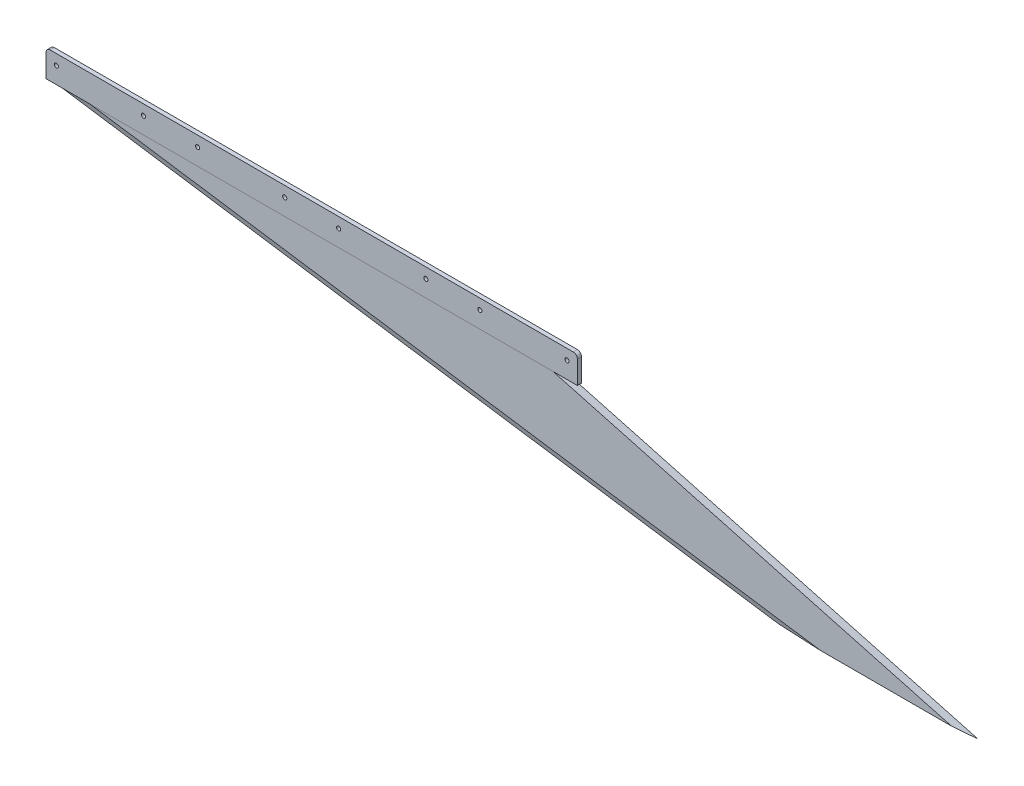
ISO-10303-21;
HEADER;
FILE_DESCRIPTION(('STEP AP214'),'2;1');
FILE_NAME('part.step','',(''),(''),'','','');
FILE_SCHEMA(('AUTOMOTIVE_DESIGN { 1 0 10303 214 1 1 1 1 }'));
ENDSEC;
DATA;
#1=APPLICATION_CONTEXT('core data for automotive mechanical design processes');
#2=APPLICATION_PROTOCOL_DEFINITION('international standard','automotive_design',2000,#1);
#3=PRODUCT_CONTEXT('',#1,'mechanical');
#4=PRODUCT('Part','Part','',(#3));
#5=PRODUCT_RELATED_PRODUCT_CATEGORY('part','',(#4));
#6=PRODUCT_DEFINITION_FORMATION('','',#4);
#7=PRODUCT_DEFINITION_CONTEXT('part definition',#1,'design');
#8=PRODUCT_DEFINITION('design','',#6,#7);
#9=PRODUCT_DEFINITION_SHAPE('','',#8);
#10=(LENGTH_UNIT() NAMED_UNIT(*) SI_UNIT(.MILLI.,.METRE.));
#11=(NAMED_UNIT(*) PLANE_ANGLE_UNIT() SI_UNIT($,.RADIAN.));
#12=(NAMED_UNIT(*) SI_UNIT($,.STERADIAN.) SOLID_ANGLE_UNIT());
#13=UNCERTAINTY_MEASURE_WITH_UNIT(LENGTH_MEASURE(1.E-05),#10,'distance_accuracy_value','');
#14=(GEOMETRIC_REPRESENTATION_CONTEXT(3) GLOBAL_UNCERTAINTY_ASSIGNED_CONTEXT((#13)) GLOBAL_UNIT_ASSIGNED_CONTEXT((#10,
#11,#12)) REPRESENTATION_CONTEXT('',''));
#15=CARTESIAN_POINT('',(0.,0.,0.));
#16=DIRECTION('',(0.,0.,1.));
#17=DIRECTION('',(1.,0.,0.));
#18=AXIS2_PLACEMENT_3D('',#15,#16,#17);
#19=CARTESIAN_POINT('',(0.,0.,0.));
#20=DIRECTION('',(0.,0.,1.));
#21=DIRECTION('',(1.,0.,0.));
#22=AXIS2_PLACEMENT_3D('',#19,#20,#21);
#23=PLANE('',#22);
#24=CARTESIAN_POINT('',(-231.775,25.4,0.));
#25=DIRECTION('',(0.,0.,1.));
#26=DIRECTION('',(1.,0.,0.));
#27=AXIS2_PLACEMENT_3D('',#24,#25,#26);
#28=CIRCLE('',#27,3.17500000000009);
#29=CARTESIAN_POINT('',(-228.6,25.4,0.));
#30=VERTEX_POINT('',#29);
#31=EDGE_CURVE('E300',#30,#30,#28,.T.);
#32=ORIENTED_EDGE('',*,*,#31,.T.);
#33=EDGE_LOOP('',(#32));
#34=FACE_BOUND('',#33,.T.);
#35=CARTESIAN_POINT('',(-365.125,25.4,0.));
#36=DIRECTION('',(0.,0.,1.));
#37=DIRECTION('',(1.,0.,0.));
#38=AXIS2_PLACEMENT_3D('',#35,#36,#37);
#39=CIRCLE('',#38,3.17500000000009);
#40=CARTESIAN_POINT('',(-361.95,25.4,0.));
#41=VERTEX_POINT('',#40);
#42=EDGE_CURVE('E307',#41,#41,#39,.T.);
#43=ORIENTED_EDGE('',*,*,#42,.T.);
#44=EDGE_LOOP('',(#43));
#45=FACE_BOUND('',#44,.T.);
#46=CARTESIAN_POINT('',(-15.875,25.3999999999999,0.));
#47=DIRECTION('',(0.,0.,1.));
#48=DIRECTION('',(1.,0.,0.));
#49=AXIS2_PLACEMENT_3D('',#46,#47,#48);
#50=CIRCLE('',#49,3.17500000000008);
#51=CARTESIAN_POINT('',(-12.6999999999999,25.3999999999999,0.));
#52=VERTEX_POINT('',#51);
#53=EDGE_CURVE('E278',#52,#52,#50,.T.);
#54=ORIENTED_EDGE('',*,*,#53,.T.);
#55=EDGE_LOOP('',(#54));
#56=FACE_BOUND('',#55,.T.);
#57=CARTESIAN_POINT('',(-581.025,25.4,0.));
#58=DIRECTION('',(0.,0.,-1.));
#59=DIRECTION('',(-1.,0.,0.));
#60=AXIS2_PLACEMENT_3D('',#57,#58,#59);
#61=CIRCLE('',#60,3.17500000000008);
#62=CARTESIAN_POINT('',(-584.2,25.4,0.));
#63=VERTEX_POINT('',#62);
#64=EDGE_CURVE('E288',#63,#63,#61,.T.);
#65=ORIENTED_EDGE('',*,*,#64,.F.);
#66=EDGE_LOOP('',(#65));
#67=FACE_BOUND('',#66,.T.);
#68=CARTESIAN_POINT('',(-149.225,25.4,0.));
#69=DIRECTION('',(0.,0.,-1.));
#70=DIRECTION('',(-1.,0.,0.));
#71=AXIS2_PLACEMENT_3D('',#68,#69,#70);
#72=CIRCLE('',#71,3.175);
#73=CARTESIAN_POINT('',(-152.4,25.4,0.));
#74=VERTEX_POINT('',#73);
#75=EDGE_CURVE('E274',#74,#74,#72,.T.);
#76=ORIENTED_EDGE('',*,*,#75,.F.);
#77=EDGE_LOOP('',(#76));
#78=FACE_BOUND('',#77,.T.);
#79=CARTESIAN_POINT('',(-663.575,25.4,0.));
#80=DIRECTION('',(0.,0.,-1.));
#81=DIRECTION('',(-1.,0.,0.));
#82=AXIS2_PLACEMENT_3D('',#79,#80,#81);
#83=CIRCLE('',#82,3.17500000000008);
#84=CARTESIAN_POINT('',(-666.75,25.4,0.));
#85=VERTEX_POINT('',#84);
#86=EDGE_CURVE('E281',#85,#85,#83,.T.);
#87=ORIENTED_EDGE('',*,*,#86,.F.);
#88=EDGE_LOOP('',(#87));
#89=FACE_BOUND('',#88,.T.);
#90=CARTESIAN_POINT('',(-447.675,25.4,0.));
#91=DIRECTION('',(0.,0.,-1.));
#92=DIRECTION('',(-1.,0.,0.));
#93=AXIS2_PLACEMENT_3D('',#90,#91,#92);
#94=CIRCLE('',#93,3.17500000000009);
#95=CARTESIAN_POINT('',(-450.85,25.4,0.));
#96=VERTEX_POINT('',#95);
#97=EDGE_CURVE('E310',#96,#96,#94,.T.);
#98=ORIENTED_EDGE('',*,*,#97,.F.);
#99=EDGE_LOOP('',(#98));
#100=FACE_BOUND('',#99,.T.);
#101=CARTESIAN_POINT('',(-796.925,25.4,0.));
#102=DIRECTION('',(0.,0.,-1.));
#103=DIRECTION('',(-1.,0.,0.));
#104=AXIS2_PLACEMENT_3D('',#101,#102,#103);
#105=CIRCLE('',#104,3.17500000000008);
#106=CARTESIAN_POINT('',(-800.1,25.4,0.));
#107=VERTEX_POINT('',#106);
#108=EDGE_CURVE('E271',#107,#107,#105,.T.);
#109=ORIENTED_EDGE('',*,*,#108,.F.);
#110=EDGE_LOOP('',(#109));
#111=FACE_BOUND('',#110,.T.);
#112=DIRECTION('',(1.,0.,0.));
#113=VECTOR('',#112,1.);
#114=CARTESIAN_POINT('',(0.,0.,0.));
#115=LINE('',#114,#113);
#116=CARTESIAN_POINT('',(-745.935604653389,0.,0.));
#117=VERTEX_POINT('',#116);
#118=CARTESIAN_POINT('',(-37.3797503889438,0.,0.));
#119=VERTEX_POINT('',#118);
#120=EDGE_CURVE('E11',#117,#119,#115,.T.);
#121=ORIENTED_EDGE('',*,*,#120,.F.);
#122=DIRECTION('',(-1.,0.,0.));
#123=VECTOR('',#122,1.);
#124=CARTESIAN_POINT('',(-812.8,0.,0.));
#125=LINE('',#124,#123);
#126=CARTESIAN_POINT('',(-812.8,0.,0.));
#127=VERTEX_POINT('',#126);
#128=EDGE_CURVE('E159',#117,#127,#125,.T.);
#129=ORIENTED_EDGE('',*,*,#128,.T.);
#130=DIRECTION('',(0.,-1.,0.));
#131=VECTOR('',#130,1.);
#132=CARTESIAN_POINT('',(-812.8,3.175,0.));
#133=LINE('',#132,#131);
#134=CARTESIAN_POINT('',(-812.8,34.925,0.));
#135=VERTEX_POINT('',#134);
#136=EDGE_CURVE('E163',#135,#127,#133,.T.);
#137=ORIENTED_EDGE('',*,*,#136,.F.);
#138=CARTESIAN_POINT('',(-806.45,34.925,0.));
#139=DIRECTION('',(0.,0.,1.));
#140=DIRECTION('',(1.,0.,0.));
#141=AXIS2_PLACEMENT_3D('',#138,#139,#140);
#142=CIRCLE('',#141,6.35);
#143=CARTESIAN_POINT('',(-806.45,41.275,0.));
#144=VERTEX_POINT('',#143);
#145=EDGE_CURVE('E226',#135,#144,#142,.F.);
#146=ORIENTED_EDGE('',*,*,#145,.T.);
#147=DIRECTION('',(-1.,0.,0.));
#148=VECTOR('',#147,1.);
#149=CARTESIAN_POINT('',(-812.8,41.275,0.));
#150=LINE('',#149,#148);
#151=CARTESIAN_POINT('',(-6.34999999999997,41.275,0.));
#152=VERTEX_POINT('',#151);
#153=EDGE_CURVE('E145',#152,#144,#150,.T.);
#154=ORIENTED_EDGE('',*,*,#153,.F.);
#155=CARTESIAN_POINT('',(-6.35,34.925,0.));
#156=DIRECTION('',(0.,0.,1.));
#157=DIRECTION('',(1.,0.,0.));
#158=AXIS2_PLACEMENT_3D('',#155,#156,#157);
#159=CIRCLE('',#158,6.35);
#160=CARTESIAN_POINT('',(0.,34.925,0.));
#161=VERTEX_POINT('',#160);
#162=EDGE_CURVE('E214',#152,#161,#159,.F.);
#163=ORIENTED_EDGE('',*,*,#162,.T.);
#164=DIRECTION('',(0.,-1.,0.));
#165=VECTOR('',#164,1.);
#166=CARTESIAN_POINT('',(0.,3.175,0.));
#167=LINE('',#166,#165);
#168=CARTESIAN_POINT('',(0.,0.,0.));
#169=VERTEX_POINT('',#168);
#170=EDGE_CURVE('E165',#161,#169,#167,.T.);
#171=ORIENTED_EDGE('',*,*,#170,.T.);
#172=EDGE_CURVE('E160',#169,#119,#125,.T.);
#173=ORIENTED_EDGE('',*,*,#172,.T.);
#174=EDGE_LOOP('',(#121,#129,#137,#146,#154,#163,#171,#173));
#175=FACE_BOUND('',#174,.T.);
#176=ADVANCED_FACE('F40',(#34,#45,#56,#67,#78,#89,#100,#111,#175),#23,.F.);
#177=CARTESIAN_POINT('',(0.,0.,6.35));
#178=DIRECTION('',(0.,0.,1.));
#179=DIRECTION('',(1.,0.,0.));
#180=AXIS2_PLACEMENT_3D('',#177,#178,#179);
#181=PLANE('',#180);
#182=CARTESIAN_POINT('',(-796.925,25.4,6.35));
#183=DIRECTION('',(0.,0.,1.));
#184=DIRECTION('',(1.,0.,0.));
#185=AXIS2_PLACEMENT_3D('',#182,#183,#184);
#186=CIRCLE('',#185,3.17500000000008);
#187=CARTESIAN_POINT('',(-793.75,25.4,6.35));
#188=VERTEX_POINT('',#187);
#189=EDGE_CURVE('E287',#188,#188,#186,.F.);
#190=ORIENTED_EDGE('',*,*,#189,.T.);
#191=EDGE_LOOP('',(#190));
#192=FACE_BOUND('',#191,.T.);
#193=CARTESIAN_POINT('',(-365.125,25.4,6.35));
#194=DIRECTION('',(0.,0.,1.));
#195=DIRECTION('',(1.,0.,0.));
#196=AXIS2_PLACEMENT_3D('',#193,#194,#195);
#197=CIRCLE('',#196,3.17500000000009);
#198=CARTESIAN_POINT('',(-361.95,25.4,6.35));
#199=VERTEX_POINT('',#198);
#200=EDGE_CURVE('E303',#199,#199,#197,.T.);
#201=ORIENTED_EDGE('',*,*,#200,.F.);
#202=EDGE_LOOP('',(#201));
#203=FACE_BOUND('',#202,.T.);
#204=CARTESIAN_POINT('',(-447.675,25.4,6.35));
#205=DIRECTION('',(0.,0.,1.));
#206=DIRECTION('',(1.,0.,0.));
#207=AXIS2_PLACEMENT_3D('',#204,#205,#206);
#208=CIRCLE('',#207,3.17500000000009);
#209=CARTESIAN_POINT('',(-444.5,25.4,6.35));
#210=VERTEX_POINT('',#209);
#211=EDGE_CURVE('E292',#210,#210,#208,.F.);
#212=ORIENTED_EDGE('',*,*,#211,.T.);
#213=EDGE_LOOP('',(#212));
#214=FACE_BOUND('',#213,.T.);
#215=CARTESIAN_POINT('',(-663.575,25.4,6.35));
#216=DIRECTION('',(0.,0.,1.));
#217=DIRECTION('',(1.,0.,0.));
#218=AXIS2_PLACEMENT_3D('',#215,#216,#217);
#219=CIRCLE('',#218,3.17500000000008);
#220=CARTESIAN_POINT('',(-660.4,25.4,6.35));
#221=VERTEX_POINT('',#220);
#222=EDGE_CURVE('E284',#221,#221,#219,.F.);
#223=ORIENTED_EDGE('',*,*,#222,.T.);
#224=EDGE_LOOP('',(#223));
#225=FACE_BOUND('',#224,.T.);
#226=CARTESIAN_POINT('',(-149.225,25.4,6.35));
#227=DIRECTION('',(0.,0.,1.));
#228=DIRECTION('',(1.,0.,0.));
#229=AXIS2_PLACEMENT_3D('',#226,#227,#228);
#230=CIRCLE('',#229,3.175);
#231=CARTESIAN_POINT('',(-146.05,25.4,6.35));
#232=VERTEX_POINT('',#231);
#233=EDGE_CURVE('E277',#232,#232,#230,.F.);
#234=ORIENTED_EDGE('',*,*,#233,.T.);
#235=EDGE_LOOP('',(#234));
#236=FACE_BOUND('',#235,.T.);
#237=CARTESIAN_POINT('',(-581.025,25.4,6.35));
#238=DIRECTION('',(0.,0.,1.));
#239=DIRECTION('',(1.,0.,0.));
#240=AXIS2_PLACEMENT_3D('',#237,#238,#239);
#241=CIRCLE('',#240,3.17500000000008);
#242=CARTESIAN_POINT('',(-577.85,25.4,6.35));
#243=VERTEX_POINT('',#242);
#244=EDGE_CURVE('E291',#243,#243,#241,.F.);
#245=ORIENTED_EDGE('',*,*,#244,.T.);
#246=EDGE_LOOP('',(#245));
#247=FACE_BOUND('',#246,.T.);
#248=CARTESIAN_POINT('',(-15.875,25.3999999999999,6.35));
#249=DIRECTION('',(0.,0.,1.));
#250=DIRECTION('',(1.,0.,0.));
#251=AXIS2_PLACEMENT_3D('',#248,#249,#250);
#252=CIRCLE('',#251,3.17500000000008);
#253=CARTESIAN_POINT('',(-12.6999999999999,25.3999999999999,6.35));
#254=VERTEX_POINT('',#253);
#255=EDGE_CURVE('E295',#254,#254,#252,.T.);
#256=ORIENTED_EDGE('',*,*,#255,.F.);
#257=EDGE_LOOP('',(#256));
#258=FACE_BOUND('',#257,.T.);
#259=CARTESIAN_POINT('',(-231.775,25.4,6.35));
#260=DIRECTION('',(0.,0.,1.));
#261=DIRECTION('',(1.,0.,0.));
#262=AXIS2_PLACEMENT_3D('',#259,#260,#261);
#263=CIRCLE('',#262,3.17500000000009);
#264=CARTESIAN_POINT('',(-228.6,25.4,6.35));
#265=VERTEX_POINT('',#264);
#266=EDGE_CURVE('E304',#265,#265,#263,.T.);
#267=ORIENTED_EDGE('',*,*,#266,.F.);
#268=EDGE_LOOP('',(#267));
#269=FACE_BOUND('',#268,.T.);
#270=DIRECTION('',(1.,0.,0.));
#271=VECTOR('',#270,1.);
#272=CARTESIAN_POINT('',(-812.8,0.,6.35));
#273=LINE('',#272,#271);
#274=CARTESIAN_POINT('',(-812.8,0.,6.35));
#275=VERTEX_POINT('',#274);
#276=CARTESIAN_POINT('',(-745.935604653391,0.,6.35));
#277=VERTEX_POINT('',#276);
#278=EDGE_CURVE('E131',#275,#277,#273,.T.);
#279=ORIENTED_EDGE('',*,*,#278,.T.);
#280=DIRECTION('',(1.,0.,0.));
#281=VECTOR('',#280,1.);
#282=CARTESIAN_POINT('',(0.,0.,6.35));
#283=LINE('',#282,#281);
#284=CARTESIAN_POINT('',(-37.379750388943,0.,6.35));
#285=VERTEX_POINT('',#284);
#286=EDGE_CURVE('E49',#277,#285,#283,.T.);
#287=ORIENTED_EDGE('',*,*,#286,.T.);
#288=CARTESIAN_POINT('',(0.,0.,6.35));
#289=VERTEX_POINT('',#288);
#290=EDGE_CURVE('E150',#285,#289,#273,.T.);
#291=ORIENTED_EDGE('',*,*,#290,.T.);
#292=DIRECTION('',(0.,-1.,0.));
#293=VECTOR('',#292,1.);
#294=CARTESIAN_POINT('',(0.,3.175,6.35));
#295=LINE('',#294,#293);
#296=CARTESIAN_POINT('',(0.,34.925,6.35));
#297=VERTEX_POINT('',#296);
#298=EDGE_CURVE('E134',#297,#289,#295,.T.);
#299=ORIENTED_EDGE('',*,*,#298,.F.);
#300=CARTESIAN_POINT('',(-6.35,34.925,6.35));
#301=DIRECTION('',(0.,0.,1.));
#302=DIRECTION('',(1.,0.,0.));
#303=AXIS2_PLACEMENT_3D('',#300,#301,#302);
#304=CIRCLE('',#303,6.35);
#305=CARTESIAN_POINT('',(-6.34999999999997,41.275,6.35));
#306=VERTEX_POINT('',#305);
#307=EDGE_CURVE('E218',#297,#306,#304,.T.);
#308=ORIENTED_EDGE('',*,*,#307,.T.);
#309=DIRECTION('',(1.,0.,0.));
#310=VECTOR('',#309,1.);
#311=CARTESIAN_POINT('',(-812.8,41.275,6.35));
#312=LINE('',#311,#310);
#313=CARTESIAN_POINT('',(-806.45,41.275,6.35));
#314=VERTEX_POINT('',#313);
#315=EDGE_CURVE('E269',#314,#306,#312,.T.);
#316=ORIENTED_EDGE('',*,*,#315,.F.);
#317=CARTESIAN_POINT('',(-806.45,34.925,6.35));
#318=DIRECTION('',(0.,0.,1.));
#319=DIRECTION('',(1.,0.,0.));
#320=AXIS2_PLACEMENT_3D('',#317,#318,#319);
#321=CIRCLE('',#320,6.35);
#322=CARTESIAN_POINT('',(-812.8,34.925,6.35));
#323=VERTEX_POINT('',#322);
#324=EDGE_CURVE('E64',#314,#323,#321,.T.);
#325=ORIENTED_EDGE('',*,*,#324,.T.);
#326=DIRECTION('',(0.,-1.,0.));
#327=VECTOR('',#326,1.);
#328=CARTESIAN_POINT('',(-812.8,3.175,6.35));
#329=LINE('',#328,#327);
#330=EDGE_CURVE('E127',#323,#275,#329,.T.);
#331=ORIENTED_EDGE('',*,*,#330,.T.);
#332=EDGE_LOOP('',(#279,#287,#291,#299,#308,#316,#325,#331));
#333=FACE_BOUND('',#332,.T.);
#334=ADVANCED_FACE('F129',(#192,#203,#214,#225,#236,#247,#258,#269,#333),#181,.T.);
#335=ORIENTED_EDGE('',*,*,#286,.F.);
#336=DIRECTION('',(-0.989263736217635,0.146141233759423,0.));
#337=VECTOR('',#336,1.);
#338=CARTESIAN_POINT('',(-15.9311408045524,-107.841568523124,6.35));
#339=LINE('',#338,#337);
#340=CARTESIAN_POINT('',(371.664395346609,-165.1,6.35));
#341=VERTEX_POINT('',#340);
#342=EDGE_CURVE('E204',#341,#277,#339,.T.);
#343=ORIENTED_EDGE('',*,*,#342,.F.);
#344=DIRECTION('',(1.,0.,0.));
#345=VECTOR('',#344,1.);
#346=CARTESIAN_POINT('',(304.8,-165.1,6.35));
#347=LINE('',#346,#345);
#348=CARTESIAN_POINT('',(572.220249611057,-165.1,6.35));
#349=VERTEX_POINT('',#348);
#350=EDGE_CURVE('E196',#341,#349,#347,.T.);
#351=ORIENTED_EDGE('',*,*,#350,.T.);
#352=DIRECTION('',(0.965226371919944,-0.261415475728318,0.));
#353=VECTOR('',#352,1.);
#354=CARTESIAN_POINT('',(-2.5544592865877,-9.43184967355457,6.35));
#355=LINE('',#354,#353);
#356=EDGE_CURVE('E209',#285,#349,#355,.T.);
#357=ORIENTED_EDGE('',*,*,#356,.F.);
#358=EDGE_LOOP('',(#335,#343,#351,#357));
#359=FACE_BOUND('',#358,.T.);
#360=ADVANCED_FACE('F242',(#359),#181,.T.);
#361=DIRECTION('',(-0.989263736217635,0.146141233759423,0.));
#362=VECTOR('',#361,1.);
#363=CARTESIAN_POINT('',(-15.9311408045524,-107.841568523124,0.));
#364=LINE('',#363,#362);
#365=CARTESIAN_POINT('',(371.66439534661,-165.1,0.));
#366=VERTEX_POINT('',#365);
#367=EDGE_CURVE('E199',#366,#117,#364,.T.);
#368=ORIENTED_EDGE('',*,*,#367,.T.);
#369=ORIENTED_EDGE('',*,*,#120,.T.);
#370=DIRECTION('',(0.965226371919944,-0.261415475728318,0.));
#371=VECTOR('',#370,1.);
#372=CARTESIAN_POINT('',(-2.55445928658775,-9.43184967355478,0.));
#373=LINE('',#372,#371);
#374=CARTESIAN_POINT('',(572.220249611057,-165.1,0.));
#375=VERTEX_POINT('',#374);
#376=EDGE_CURVE('E206',#119,#375,#373,.T.);
#377=ORIENTED_EDGE('',*,*,#376,.T.);
#378=DIRECTION('',(1.,0.,0.));
#379=VECTOR('',#378,1.);
#380=CARTESIAN_POINT('',(304.8,-165.1,0.));
#381=LINE('',#380,#379);
#382=EDGE_CURVE('E195',#366,#375,#381,.T.);
#383=ORIENTED_EDGE('',*,*,#382,.F.);
#384=EDGE_LOOP('',(#368,#369,#377,#383));
#385=FACE_BOUND('',#384,.T.);
#386=ADVANCED_FACE('F327',(#385),#23,.F.);
#387=CARTESIAN_POINT('',(304.8,-165.1,6.35));
#388=DIRECTION('',(0.,1.,0.));
#389=DIRECTION('',(0.,0.,1.));
#390=AXIS2_PLACEMENT_3D('',#387,#388,#389);
#391=PLANE('',#390);
#392=ORIENTED_EDGE('',*,*,#382,.T.);
#393=DIRECTION('',(0.996412082519267,0.,0.0846342827087045));
#394=VECTOR('',#393,1.);
#395=CARTESIAN_POINT('',(307.25102048406,-165.1,-22.5062311472001));
#396=LINE('',#395,#394);
#397=CARTESIAN_POINT('',(609.6,-165.1,3.175));
#398=VERTEX_POINT('',#397);
#399=EDGE_CURVE('E173',#375,#398,#396,.T.);
#400=ORIENTED_EDGE('',*,*,#399,.T.);
#401=DIRECTION('',(-0.996412082519267,0.,0.0846342827087064));
#402=VECTOR('',#401,1.);
#403=CARTESIAN_POINT('',(306.715521035082,-165.1,28.9017159546918));
#404=LINE('',#403,#402);
#405=EDGE_CURVE('E179',#398,#349,#404,.T.);
#406=ORIENTED_EDGE('',*,*,#405,.T.);
#407=ORIENTED_EDGE('',*,*,#350,.F.);
#408=DIRECTION('',(-0.998874529903472,0.,-0.0474307232721332));
#409=VECTOR('',#408,1.);
#410=CARTESIAN_POINT('',(304.950423058981,-165.1,3.18214271339463));
#411=LINE('',#410,#409);
#412=CARTESIAN_POINT('',(304.799999999999,-165.1,3.17499999999997));
#413=VERTEX_POINT('',#412);
#414=EDGE_CURVE('E192',#341,#413,#411,.T.);
#415=ORIENTED_EDGE('',*,*,#414,.T.);
#416=DIRECTION('',(0.998874529903472,0.,-0.0474307232721321));
#417=VECTOR('',#416,1.);
#418=CARTESIAN_POINT('',(304.649576941019,-165.1,3.18214271339462));
#419=LINE('',#418,#417);
#420=EDGE_CURVE('E188',#413,#366,#419,.T.);
#421=ORIENTED_EDGE('',*,*,#420,.T.);
#422=EDGE_LOOP('',(#392,#400,#406,#407,#415,#421));
#423=FACE_BOUND('',#422,.T.);
#424=ADVANCED_FACE('F245',(#423),#391,.F.);
#425=CARTESIAN_POINT('',(603.090307089599,-209.165613547327,3.175));
#426=DIRECTION('',(0.0451601248105842,0.305699306410108,-0.951056516295152));
#427=DIRECTION('',(0.,0.952027812084015,0.306011511251658));
#428=AXIS2_PLACEMENT_3D('',#425,#426,#427);
#429=PLANE('',#428);
#430=ORIENTED_EDGE('',*,*,#342,.T.);
#431=DIRECTION('',(-0.998874529903472,0.,-0.0474307232721332));
#432=VECTOR('',#431,1.);
#433=CARTESIAN_POINT('',(-812.649576941019,0.,3.18214271339462));
#434=LINE('',#433,#432);
#435=CARTESIAN_POINT('',(-812.8,0.,3.175));
#436=VERTEX_POINT('',#435);
#437=EDGE_CURVE('E148',#277,#436,#434,.T.);
#438=ORIENTED_EDGE('',*,*,#437,.T.);
#439=DIRECTION('',(-0.989263736217635,0.146141233759423,0.));
#440=VECTOR('',#439,1.);
#441=CARTESIAN_POINT('',(603.090307089599,-209.165613547327,3.175));
#442=LINE('',#441,#440);
#443=EDGE_CURVE('E182',#413,#436,#442,.T.);
#444=ORIENTED_EDGE('',*,*,#443,.F.);
#445=ORIENTED_EDGE('',*,*,#414,.F.);
#446=EDGE_LOOP('',(#430,#438,#444,#445));
#447=FACE_BOUND('',#446,.T.);
#448=ADVANCED_FACE('F341',(#447),#429,.F.);
#449=CARTESIAN_POINT('',(603.090307089599,-209.165613547327,3.175));
#450=DIRECTION('',(0.0451601248105833,0.305699306410102,0.951056516295154));
#451=DIRECTION('',(0.,-0.952027812084017,0.306011511251652));
#452=AXIS2_PLACEMENT_3D('',#449,#450,#451);
#453=PLANE('',#452);
#454=ORIENTED_EDGE('',*,*,#443,.T.);
#455=DIRECTION('',(0.998874529903472,0.,-0.0474307232721321));
#456=VECTOR('',#455,1.);
#457=CARTESIAN_POINT('',(-812.950423058981,0.,3.18214271339462));
#458=LINE('',#457,#456);
#459=EDGE_CURVE('E185',#436,#117,#458,.T.);
#460=ORIENTED_EDGE('',*,*,#459,.T.);
#461=ORIENTED_EDGE('',*,*,#367,.F.);
#462=ORIENTED_EDGE('',*,*,#420,.F.);
#463=EDGE_LOOP('',(#454,#460,#461,#462));
#464=FACE_BOUND('',#463,.T.);
#465=ADVANCED_FACE('F344',(#464),#453,.F.);
#466=CARTESIAN_POINT('',(-86.9208631466368,23.5410671022141,3.175));
#467=DIRECTION('',(-0.0807818245926628,-0.29827135234214,-0.951056516295152));
#468=DIRECTION('',(0.,0.954174943337679,-0.299249356735378));
#469=AXIS2_PLACEMENT_3D('',#466,#467,#468);
#470=PLANE('',#469);
#471=DIRECTION('',(0.965226371919944,-0.261415475728318,0.));
#472=VECTOR('',#471,1.);
#473=CARTESIAN_POINT('',(-86.9208631466368,23.5410671022141,3.175));
#474=LINE('',#473,#472);
#475=CARTESIAN_POINT('',(0.,0.,3.17499999999998));
#476=VERTEX_POINT('',#475);
#477=EDGE_CURVE('E133',#476,#398,#474,.T.);
#478=ORIENTED_EDGE('',*,*,#477,.F.);
#479=DIRECTION('',(-0.996412082519267,0.,0.0846342827087064));
#480=VECTOR('',#479,1.);
#481=CARTESIAN_POINT('',(-807.245694365632,0.,71.7416718729355));
#482=LINE('',#481,#480);
#483=EDGE_CURVE('E176',#476,#285,#482,.T.);
#484=ORIENTED_EDGE('',*,*,#483,.T.);
#485=ORIENTED_EDGE('',*,*,#356,.T.);
#486=ORIENTED_EDGE('',*,*,#405,.F.);
#487=EDGE_LOOP('',(#478,#484,#485,#486));
#488=FACE_BOUND('',#487,.T.);
#489=ADVANCED_FACE('F241',(#488),#470,.F.);
#490=CARTESIAN_POINT('',(-86.9208631466368,23.5410671022141,3.175));
#491=DIRECTION('',(-0.0807818245926612,-0.298271352342134,0.951056516295154));
#492=DIRECTION('',(0.,-0.954174943337681,-0.299249356735372));
#493=AXIS2_PLACEMENT_3D('',#490,#491,#492);
#494=PLANE('',#493);
#495=ORIENTED_EDGE('',*,*,#376,.F.);
#496=DIRECTION('',(0.996412082519267,0.,0.0846342827087045));
#497=VECTOR('',#496,1.);
#498=CARTESIAN_POINT('',(-806.710194916654,0.,-65.3461870654429));
#499=LINE('',#498,#497);
#500=EDGE_CURVE('E170',#119,#476,#499,.T.);
#501=ORIENTED_EDGE('',*,*,#500,.T.);
#502=ORIENTED_EDGE('',*,*,#477,.T.);
#503=ORIENTED_EDGE('',*,*,#399,.F.);
#504=EDGE_LOOP('',(#495,#501,#502,#503));
#505=FACE_BOUND('',#504,.T.);
#506=ADVANCED_FACE('F248',(#505),#494,.F.);
#507=CARTESIAN_POINT('',(0.,0.,0.));
#508=DIRECTION('',(0.,1.,0.));
#509=DIRECTION('',(0.,0.,1.));
#510=AXIS2_PLACEMENT_3D('',#507,#508,#509);
#511=PLANE('',#510);
#512=ORIENTED_EDGE('',*,*,#459,.F.);
#513=DIRECTION('',(0.,0.,1.));
#514=VECTOR('',#513,1.);
#515=CARTESIAN_POINT('',(-812.8,0.,0.));
#516=LINE('',#515,#514);
#517=EDGE_CURVE('E141',#127,#436,#516,.T.);
#518=ORIENTED_EDGE('',*,*,#517,.F.);
#519=ORIENTED_EDGE('',*,*,#128,.F.);
#520=EDGE_LOOP('',(#512,#518,#519));
#521=FACE_BOUND('',#520,.T.);
#522=ADVANCED_FACE('F347',(#521),#511,.F.);
#523=ORIENTED_EDGE('',*,*,#437,.F.);
#524=ORIENTED_EDGE('',*,*,#278,.F.);
#525=EDGE_CURVE('E138',#436,#275,#516,.T.);
#526=ORIENTED_EDGE('',*,*,#525,.F.);
#527=EDGE_LOOP('',(#523,#524,#526));
#528=FACE_BOUND('',#527,.T.);
#529=ADVANCED_FACE('F147',(#528),#511,.F.);
#530=ORIENTED_EDGE('',*,*,#500,.F.);
#531=ORIENTED_EDGE('',*,*,#172,.F.);
#532=DIRECTION('',(0.,0.,-1.));
#533=VECTOR('',#532,1.);
#534=CARTESIAN_POINT('',(0.,0.,0.));
#535=LINE('',#534,#533);
#536=EDGE_CURVE('E149',#476,#169,#535,.T.);
#537=ORIENTED_EDGE('',*,*,#536,.F.);
#538=EDGE_LOOP('',(#530,#531,#537));
#539=FACE_BOUND('',#538,.T.);
#540=ADVANCED_FACE('F252',(#539),#511,.F.);
#541=CARTESIAN_POINT('',(-812.8,3.175,0.));
#542=DIRECTION('',(1.,0.,0.));
#543=DIRECTION('',(0.,0.,-1.));
#544=AXIS2_PLACEMENT_3D('',#541,#542,#543);
#545=PLANE('',#544);
#546=ORIENTED_EDGE('',*,*,#330,.F.);
#547=DIRECTION('',(0.,0.,1.));
#548=VECTOR('',#547,1.);
#549=CARTESIAN_POINT('',(-812.8,34.925,0.));
#550=LINE('',#549,#548);
#551=EDGE_CURVE('E56',#323,#135,#550,.F.);
#552=ORIENTED_EDGE('',*,*,#551,.T.);
#553=ORIENTED_EDGE('',*,*,#136,.T.);
#554=ORIENTED_EDGE('',*,*,#517,.T.);
#555=ORIENTED_EDGE('',*,*,#525,.T.);
#556=EDGE_LOOP('',(#546,#552,#553,#554,#555));
#557=FACE_BOUND('',#556,.T.);
#558=ADVANCED_FACE('F139',(#557),#545,.F.);
#559=CARTESIAN_POINT('',(0.,3.175,0.));
#560=DIRECTION('',(-1.,0.,0.));
#561=DIRECTION('',(0.,0.,1.));
#562=AXIS2_PLACEMENT_3D('',#559,#560,#561);
#563=PLANE('',#562);
#564=ORIENTED_EDGE('',*,*,#170,.F.);
#565=DIRECTION('',(0.,0.,-1.));
#566=VECTOR('',#565,1.);
#567=CARTESIAN_POINT('',(0.,34.925,6.35));
#568=LINE('',#567,#566);
#569=EDGE_CURVE('E216',#161,#297,#568,.F.);
#570=ORIENTED_EDGE('',*,*,#569,.T.);
#571=ORIENTED_EDGE('',*,*,#298,.T.);
#572=EDGE_CURVE('E153',#289,#476,#535,.T.);
#573=ORIENTED_EDGE('',*,*,#572,.T.);
#574=ORIENTED_EDGE('',*,*,#536,.T.);
#575=EDGE_LOOP('',(#564,#570,#571,#573,#574));
#576=FACE_BOUND('',#575,.T.);
#577=ADVANCED_FACE('F260',(#576),#563,.F.);
#578=ORIENTED_EDGE('',*,*,#483,.F.);
#579=ORIENTED_EDGE('',*,*,#572,.F.);
#580=ORIENTED_EDGE('',*,*,#290,.F.);
#581=EDGE_LOOP('',(#578,#579,#580));
#582=FACE_BOUND('',#581,.T.);
#583=ADVANCED_FACE('F237',(#582),#511,.F.);
#584=CARTESIAN_POINT('',(0.,41.275,0.));
#585=DIRECTION('',(0.,1.,0.));
#586=DIRECTION('',(0.,0.,1.));
#587=AXIS2_PLACEMENT_3D('',#584,#585,#586);
#588=PLANE('',#587);
#589=ORIENTED_EDGE('',*,*,#153,.T.);
#590=DIRECTION('',(0.,0.,1.));
#591=VECTOR('',#590,1.);
#592=CARTESIAN_POINT('',(-806.45,41.275,6.35));
#593=LINE('',#592,#591);
#594=EDGE_CURVE('E221',#144,#314,#593,.T.);
#595=ORIENTED_EDGE('',*,*,#594,.T.);
#596=ORIENTED_EDGE('',*,*,#315,.T.);
#597=DIRECTION('',(0.,0.,-1.));
#598=VECTOR('',#597,1.);
#599=CARTESIAN_POINT('',(-6.35,41.275,0.));
#600=LINE('',#599,#598);
#601=EDGE_CURVE('E211',#306,#152,#600,.T.);
#602=ORIENTED_EDGE('',*,*,#601,.T.);
#603=EDGE_LOOP('',(#589,#595,#596,#602));
#604=FACE_BOUND('',#603,.T.);
#605=ADVANCED_FACE('F267',(#604),#588,.T.);
#606=CARTESIAN_POINT('',(-6.35,34.925,0.));
#607=DIRECTION('',(0.,0.,1.));
#608=DIRECTION('',(1.,0.,0.));
#609=AXIS2_PLACEMENT_3D('',#606,#607,#608);
#610=CYLINDRICAL_SURFACE('',#609,6.35);
#611=ORIENTED_EDGE('',*,*,#307,.F.);
#612=ORIENTED_EDGE('',*,*,#569,.F.);
#613=ORIENTED_EDGE('',*,*,#162,.F.);
#614=ORIENTED_EDGE('',*,*,#601,.F.);
#615=EDGE_LOOP('',(#611,#612,#613,#614));
#616=FACE_BOUND('',#615,.T.);
#617=ADVANCED_FACE('F264',(#616),#610,.T.);
#618=CARTESIAN_POINT('',(-806.45,34.925,0.));
#619=DIRECTION('',(0.,0.,-1.));
#620=DIRECTION('',(-1.,0.,0.));
#621=AXIS2_PLACEMENT_3D('',#618,#619,#620);
#622=CYLINDRICAL_SURFACE('',#621,6.35);
#623=ORIENTED_EDGE('',*,*,#145,.F.);
#624=ORIENTED_EDGE('',*,*,#551,.F.);
#625=ORIENTED_EDGE('',*,*,#324,.F.);
#626=ORIENTED_EDGE('',*,*,#594,.F.);
#627=EDGE_LOOP('',(#623,#624,#625,#626));
#628=FACE_BOUND('',#627,.T.);
#629=ADVANCED_FACE('F42',(#628),#622,.T.);
#630=CARTESIAN_POINT('',(-581.025,25.4,6.351));
#631=DIRECTION('',(0.,0.,-1.));
#632=DIRECTION('',(-1.,0.,0.));
#633=AXIS2_PLACEMENT_3D('',#630,#631,#632);
#634=CYLINDRICAL_SURFACE('',#633,3.17500000000008);
#635=ORIENTED_EDGE('',*,*,#244,.F.);
#636=EDGE_LOOP('',(#635));
#637=FACE_BOUND('',#636,.T.);
#638=ORIENTED_EDGE('',*,*,#64,.T.);
#639=EDGE_LOOP('',(#638));
#640=FACE_BOUND('',#639,.T.);
#641=ADVANCED_FACE('F350',(#637,#640),#634,.F.);
#642=CARTESIAN_POINT('',(-15.875,25.3999999999999,6.351));
#643=DIRECTION('',(0.,0.,-1.));
#644=DIRECTION('',(-1.,0.,0.));
#645=AXIS2_PLACEMENT_3D('',#642,#643,#644);
#646=CYLINDRICAL_SURFACE('',#645,3.17500000000008);
#647=ORIENTED_EDGE('',*,*,#255,.T.);
#648=EDGE_LOOP('',(#647));
#649=FACE_BOUND('',#648,.T.);
#650=ORIENTED_EDGE('',*,*,#53,.F.);
#651=EDGE_LOOP('',(#650));
#652=FACE_BOUND('',#651,.T.);
#653=ADVANCED_FACE('F355',(#649,#652),#646,.F.);
#654=CARTESIAN_POINT('',(-149.225,25.4,6.351));
#655=DIRECTION('',(0.,0.,-1.));
#656=DIRECTION('',(-1.,0.,0.));
#657=AXIS2_PLACEMENT_3D('',#654,#655,#656);
#658=CYLINDRICAL_SURFACE('',#657,3.175);
#659=ORIENTED_EDGE('',*,*,#233,.F.);
#660=EDGE_LOOP('',(#659));
#661=FACE_BOUND('',#660,.T.);
#662=ORIENTED_EDGE('',*,*,#75,.T.);
#663=EDGE_LOOP('',(#662));
#664=FACE_BOUND('',#663,.T.);
#665=ADVANCED_FACE('F367',(#661,#664),#658,.F.);
#666=CARTESIAN_POINT('',(-663.575,25.4,6.351));
#667=DIRECTION('',(0.,0.,-1.));
#668=DIRECTION('',(-1.,0.,0.));
#669=AXIS2_PLACEMENT_3D('',#666,#667,#668);
#670=CYLINDRICAL_SURFACE('',#669,3.17500000000008);
#671=ORIENTED_EDGE('',*,*,#222,.F.);
#672=EDGE_LOOP('',(#671));
#673=FACE_BOUND('',#672,.T.);
#674=ORIENTED_EDGE('',*,*,#86,.T.);
#675=EDGE_LOOP('',(#674));
#676=FACE_BOUND('',#675,.T.);
#677=ADVANCED_FACE('F466',(#673,#676),#670,.F.);
#678=CARTESIAN_POINT('',(-447.675,25.4,6.351));
#679=DIRECTION('',(0.,0.,-1.));
#680=DIRECTION('',(-1.,0.,0.));
#681=AXIS2_PLACEMENT_3D('',#678,#679,#680);
#682=CYLINDRICAL_SURFACE('',#681,3.17500000000009);
#683=ORIENTED_EDGE('',*,*,#211,.F.);
#684=EDGE_LOOP('',(#683));
#685=FACE_BOUND('',#684,.T.);
#686=ORIENTED_EDGE('',*,*,#97,.T.);
#687=EDGE_LOOP('',(#686));
#688=FACE_BOUND('',#687,.T.);
#689=ADVANCED_FACE('F474',(#685,#688),#682,.F.);
#690=CARTESIAN_POINT('',(-365.125,25.4,6.351));
#691=DIRECTION('',(0.,0.,-1.));
#692=DIRECTION('',(-1.,0.,0.));
#693=AXIS2_PLACEMENT_3D('',#690,#691,#692);
#694=CYLINDRICAL_SURFACE('',#693,3.17500000000009);
#695=ORIENTED_EDGE('',*,*,#200,.T.);
#696=EDGE_LOOP('',(#695));
#697=FACE_BOUND('',#696,.T.);
#698=ORIENTED_EDGE('',*,*,#42,.F.);
#699=EDGE_LOOP('',(#698));
#700=FACE_BOUND('',#699,.T.);
#701=ADVANCED_FACE('F482',(#697,#700),#694,.F.);
#702=CARTESIAN_POINT('',(-231.775,25.4,6.351));
#703=DIRECTION('',(0.,0.,-1.));
#704=DIRECTION('',(-1.,0.,0.));
#705=AXIS2_PLACEMENT_3D('',#702,#703,#704);
#706=CYLINDRICAL_SURFACE('',#705,3.17500000000009);
#707=ORIENTED_EDGE('',*,*,#266,.T.);
#708=EDGE_LOOP('',(#707));
#709=FACE_BOUND('',#708,.T.);
#710=ORIENTED_EDGE('',*,*,#31,.F.);
#711=EDGE_LOOP('',(#710));
#712=FACE_BOUND('',#711,.T.);
#713=ADVANCED_FACE('F491',(#709,#712),#706,.F.);
#714=CARTESIAN_POINT('',(-796.925,25.4,6.351));
#715=DIRECTION('',(0.,0.,-1.));
#716=DIRECTION('',(-1.,0.,0.));
#717=AXIS2_PLACEMENT_3D('',#714,#715,#716);
#718=CYLINDRICAL_SURFACE('',#717,3.17500000000008);
#719=ORIENTED_EDGE('',*,*,#189,.F.);
#720=EDGE_LOOP('',(#719));
#721=FACE_BOUND('',#720,.T.);
#722=ORIENTED_EDGE('',*,*,#108,.T.);
#723=EDGE_LOOP('',(#722));
#724=FACE_BOUND('',#723,.T.);
#725=ADVANCED_FACE('F322',(#721,#724),#718,.F.);
#726=CLOSED_SHELL('',(#176,#334,#360,#386,#424,#448,#465,#489,#506,#522,#529,#540,#558,#577,
#583,#605,#617,#629,#641,#653,#665,#677,#689,#701,#713,#725));
#727=MANIFOLD_SOLID_BREP('B2',#726);
#728=ADVANCED_BREP_SHAPE_REPRESENTATION('',(#18,#727),#14);
#729=SHAPE_DEFINITION_REPRESENTATION(#9,#728);
ENDSEC;
END-ISO-10303-21;
